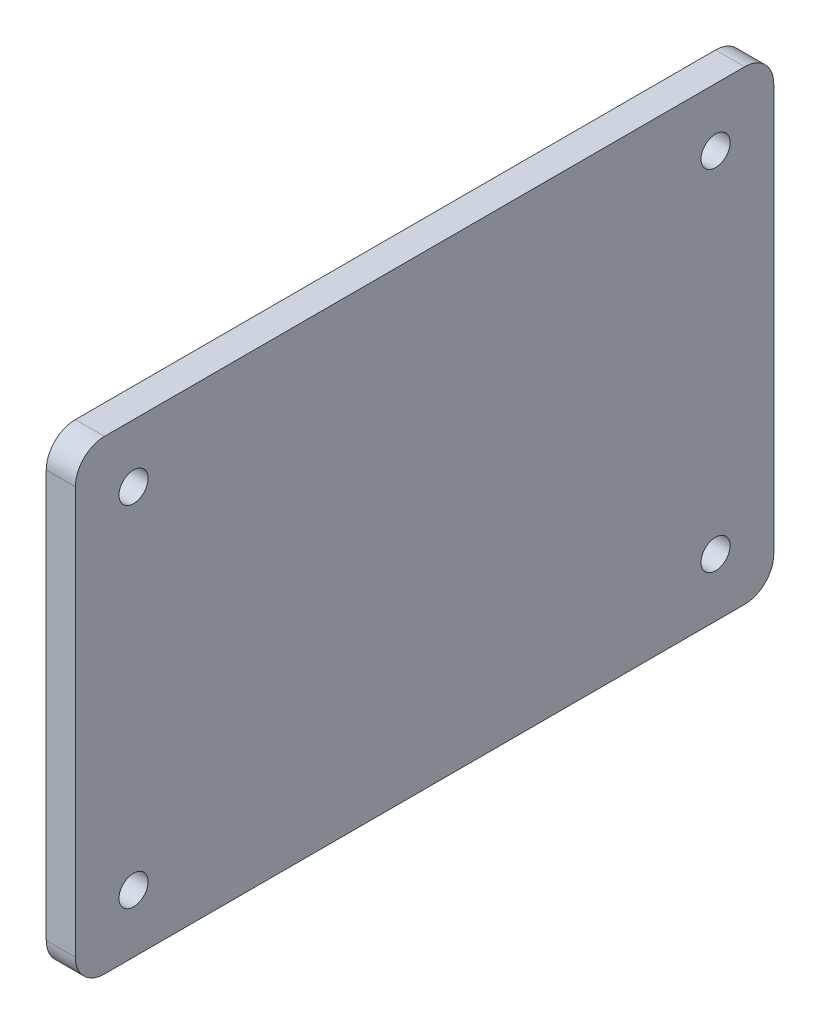
ISO-10303-21;
HEADER;
FILE_DESCRIPTION(('STEP AP214'),'2;1');
FILE_NAME('part.step','',(''),(''),'','','');
FILE_SCHEMA(('AUTOMOTIVE_DESIGN { 1 0 10303 214 1 1 1 1 }'));
ENDSEC;
DATA;
#1=APPLICATION_CONTEXT('core data for automotive mechanical design processes');
#2=APPLICATION_PROTOCOL_DEFINITION('international standard','automotive_design',2000,#1);
#3=PRODUCT_CONTEXT('',#1,'mechanical');
#4=PRODUCT('Part','Part','',(#3));
#5=PRODUCT_RELATED_PRODUCT_CATEGORY('part','',(#4));
#6=PRODUCT_DEFINITION_FORMATION('','',#4);
#7=PRODUCT_DEFINITION_CONTEXT('part definition',#1,'design');
#8=PRODUCT_DEFINITION('design','',#6,#7);
#9=PRODUCT_DEFINITION_SHAPE('','',#8);
#10=(LENGTH_UNIT() NAMED_UNIT(*) SI_UNIT(.MILLI.,.METRE.));
#11=(NAMED_UNIT(*) PLANE_ANGLE_UNIT() SI_UNIT($,.RADIAN.));
#12=(NAMED_UNIT(*) SI_UNIT($,.STERADIAN.) SOLID_ANGLE_UNIT());
#13=UNCERTAINTY_MEASURE_WITH_UNIT(LENGTH_MEASURE(1.E-05),#10,'distance_accuracy_value','');
#14=(GEOMETRIC_REPRESENTATION_CONTEXT(3) GLOBAL_UNCERTAINTY_ASSIGNED_CONTEXT((#13)) GLOBAL_UNIT_ASSIGNED_CONTEXT((#10,
#11,#12)) REPRESENTATION_CONTEXT('',''));
#15=CARTESIAN_POINT('',(0.,0.,0.));
#16=DIRECTION('',(0.,0.,1.));
#17=DIRECTION('',(1.,0.,0.));
#18=AXIS2_PLACEMENT_3D('',#15,#16,#17);
#19=CARTESIAN_POINT('',(-330.199999999993,107.95,-279.400000000002));
#20=DIRECTION('',(-1.,0.,0.));
#21=DIRECTION('',(0.,0.,1.));
#22=AXIS2_PLACEMENT_3D('',#19,#20,#21);
#23=CYLINDRICAL_SURFACE('',#22,3.17499999999998);
#24=CARTESIAN_POINT('',(-323.849999999993,107.95,-279.400000000002));
#25=DIRECTION('',(-1.,0.,0.));
#26=DIRECTION('',(0.,0.,1.));
#27=AXIS2_PLACEMENT_3D('',#24,#25,#26);
#28=CIRCLE('',#27,3.17499999999998);
#29=CARTESIAN_POINT('',(-323.849999999993,107.95,-276.225000000002));
#30=VERTEX_POINT('',#29);
#31=EDGE_CURVE('E174',#30,#30,#28,.T.);
#32=ORIENTED_EDGE('',*,*,#31,.F.);
#33=EDGE_LOOP('',(#32));
#34=FACE_BOUND('',#33,.T.);
#35=CARTESIAN_POINT('',(-330.199999999993,107.95,-279.400000000002));
#36=DIRECTION('',(-1.,0.,0.));
#37=DIRECTION('',(0.,0.,1.));
#38=AXIS2_PLACEMENT_3D('',#35,#36,#37);
#39=CIRCLE('',#38,3.17499999999998);
#40=CARTESIAN_POINT('',(-330.199999999993,107.95,-276.225000000002));
#41=VERTEX_POINT('',#40);
#42=EDGE_CURVE('E178',#41,#41,#39,.T.);
#43=ORIENTED_EDGE('',*,*,#42,.T.);
#44=EDGE_LOOP('',(#43));
#45=FACE_BOUND('',#44,.T.);
#46=ADVANCED_FACE('F57',(#34,#45),#23,.F.);
#47=CARTESIAN_POINT('',(-330.199999999993,31.75,-279.400000000002));
#48=DIRECTION('',(-1.,0.,0.));
#49=DIRECTION('',(0.,0.,1.));
#50=AXIS2_PLACEMENT_3D('',#47,#48,#49);
#51=CYLINDRICAL_SURFACE('',#50,3.17499999999998);
#52=CARTESIAN_POINT('',(-323.849999999993,31.75,-279.400000000002));
#53=DIRECTION('',(-1.,0.,0.));
#54=DIRECTION('',(0.,0.,1.));
#55=AXIS2_PLACEMENT_3D('',#52,#53,#54);
#56=CIRCLE('',#55,3.17499999999998);
#57=CARTESIAN_POINT('',(-323.849999999993,31.75,-276.225000000002));
#58=VERTEX_POINT('',#57);
#59=EDGE_CURVE('E166',#58,#58,#56,.T.);
#60=ORIENTED_EDGE('',*,*,#59,.F.);
#61=EDGE_LOOP('',(#60));
#62=FACE_BOUND('',#61,.T.);
#63=CARTESIAN_POINT('',(-330.199999999993,31.75,-279.400000000002));
#64=DIRECTION('',(-1.,0.,0.));
#65=DIRECTION('',(0.,0.,1.));
#66=AXIS2_PLACEMENT_3D('',#63,#64,#65);
#67=CIRCLE('',#66,3.17499999999998);
#68=CARTESIAN_POINT('',(-330.199999999993,31.75,-276.225000000002));
#69=VERTEX_POINT('',#68);
#70=EDGE_CURVE('E170',#69,#69,#67,.T.);
#71=ORIENTED_EDGE('',*,*,#70,.T.);
#72=EDGE_LOOP('',(#71));
#73=FACE_BOUND('',#72,.T.);
#74=ADVANCED_FACE('F277',(#62,#73),#51,.F.);
#75=CARTESIAN_POINT('',(-330.199999999993,120.65,-419.100000000002));
#76=DIRECTION('',(0.,0.,1.));
#77=DIRECTION('',(1.,0.,0.));
#78=AXIS2_PLACEMENT_3D('',#75,#76,#77);
#79=PLANE('',#78);
#80=DIRECTION('',(0.,-1.,0.));
#81=VECTOR('',#80,1.);
#82=CARTESIAN_POINT('',(-323.849999999993,120.65,-419.100000000002));
#83=LINE('',#82,#81);
#84=CARTESIAN_POINT('',(-323.849999999993,114.3,-419.100000000002));
#85=VERTEX_POINT('',#84);
#86=CARTESIAN_POINT('',(-323.849999999993,25.4,-419.100000000002));
#87=VERTEX_POINT('',#86);
#88=EDGE_CURVE('E220',#85,#87,#83,.T.);
#89=ORIENTED_EDGE('',*,*,#88,.T.);
#90=DIRECTION('',(1.,0.,0.));
#91=VECTOR('',#90,1.);
#92=CARTESIAN_POINT('',(-330.199999999993,25.4,-419.100000000002));
#93=LINE('',#92,#91);
#94=CARTESIAN_POINT('',(-330.199999999993,25.4,-419.100000000002));
#95=VERTEX_POINT('',#94);
#96=EDGE_CURVE('E13',#87,#95,#93,.F.);
#97=ORIENTED_EDGE('',*,*,#96,.T.);
#98=DIRECTION('',(0.,-1.,0.));
#99=VECTOR('',#98,1.);
#100=CARTESIAN_POINT('',(-330.199999999993,120.65,-419.100000000002));
#101=LINE('',#100,#99);
#102=CARTESIAN_POINT('',(-330.199999999993,114.3,-419.100000000002));
#103=VERTEX_POINT('',#102);
#104=EDGE_CURVE('E154',#103,#95,#101,.T.);
#105=ORIENTED_EDGE('',*,*,#104,.F.);
#106=DIRECTION('',(1.,0.,0.));
#107=VECTOR('',#106,1.);
#108=CARTESIAN_POINT('',(-330.199999999993,114.3,-419.100000000002));
#109=LINE('',#108,#107);
#110=EDGE_CURVE('E66',#103,#85,#109,.T.);
#111=ORIENTED_EDGE('',*,*,#110,.T.);
#112=EDGE_LOOP('',(#89,#97,#105,#111));
#113=FACE_BOUND('',#112,.T.);
#114=ADVANCED_FACE('F219',(#113),#79,.F.);
#115=CARTESIAN_POINT('',(-330.199999999993,19.05,-419.100000000002));
#116=DIRECTION('',(0.,1.,0.));
#117=DIRECTION('',(0.,0.,1.));
#118=AXIS2_PLACEMENT_3D('',#115,#116,#117);
#119=PLANE('',#118);
#120=DIRECTION('',(0.,0.,1.));
#121=VECTOR('',#120,1.);
#122=CARTESIAN_POINT('',(-323.849999999993,19.05,-419.100000000002));
#123=LINE('',#122,#121);
#124=CARTESIAN_POINT('',(-323.849999999993,19.05,-412.750000000002));
#125=VERTEX_POINT('',#124);
#126=CARTESIAN_POINT('',(-323.849999999993,19.05,-273.050000000002));
#127=VERTEX_POINT('',#126);
#128=EDGE_CURVE('E162',#125,#127,#123,.T.);
#129=ORIENTED_EDGE('',*,*,#128,.T.);
#130=DIRECTION('',(1.,0.,0.));
#131=VECTOR('',#130,1.);
#132=CARTESIAN_POINT('',(-330.199999999993,19.05,-273.050000000002));
#133=LINE('',#132,#131);
#134=CARTESIAN_POINT('',(-330.199999999993,19.05,-273.050000000002));
#135=VERTEX_POINT('',#134);
#136=EDGE_CURVE('E73',#127,#135,#133,.F.);
#137=ORIENTED_EDGE('',*,*,#136,.T.);
#138=DIRECTION('',(0.,0.,1.));
#139=VECTOR('',#138,1.);
#140=CARTESIAN_POINT('',(-330.199999999993,19.05,-419.100000000002));
#141=LINE('',#140,#139);
#142=CARTESIAN_POINT('',(-330.199999999993,19.05,-412.750000000002));
#143=VERTEX_POINT('',#142);
#144=EDGE_CURVE('E160',#143,#135,#141,.T.);
#145=ORIENTED_EDGE('',*,*,#144,.F.);
#146=DIRECTION('',(1.,0.,0.));
#147=VECTOR('',#146,1.);
#148=CARTESIAN_POINT('',(-330.199999999993,19.05,-412.750000000002));
#149=LINE('',#148,#147);
#150=EDGE_CURVE('E207',#143,#125,#149,.T.);
#151=ORIENTED_EDGE('',*,*,#150,.T.);
#152=EDGE_LOOP('',(#129,#137,#145,#151));
#153=FACE_BOUND('',#152,.T.);
#154=ADVANCED_FACE('F301',(#153),#119,.F.);
#155=CARTESIAN_POINT('',(-330.199999999993,120.65,-266.700000000002));
#156=DIRECTION('',(0.,0.,-1.));
#157=DIRECTION('',(-1.,0.,0.));
#158=AXIS2_PLACEMENT_3D('',#155,#156,#157);
#159=PLANE('',#158);
#160=DIRECTION('',(0.,1.,0.));
#161=VECTOR('',#160,1.);
#162=CARTESIAN_POINT('',(-323.849999999993,120.65,-266.700000000002));
#163=LINE('',#162,#161);
#164=CARTESIAN_POINT('',(-323.849999999993,25.4,-266.700000000002));
#165=VERTEX_POINT('',#164);
#166=CARTESIAN_POINT('',(-323.849999999993,114.3,-266.700000000002));
#167=VERTEX_POINT('',#166);
#168=EDGE_CURVE('E155',#165,#167,#163,.T.);
#169=ORIENTED_EDGE('',*,*,#168,.T.);
#170=DIRECTION('',(1.,0.,0.));
#171=VECTOR('',#170,1.);
#172=CARTESIAN_POINT('',(-330.199999999993,114.3,-266.700000000002));
#173=LINE('',#172,#171);
#174=CARTESIAN_POINT('',(-330.199999999993,114.3,-266.700000000002));
#175=VERTEX_POINT('',#174);
#176=EDGE_CURVE('E129',#167,#175,#173,.F.);
#177=ORIENTED_EDGE('',*,*,#176,.T.);
#178=DIRECTION('',(0.,1.,0.));
#179=VECTOR('',#178,1.);
#180=CARTESIAN_POINT('',(-330.199999999993,120.65,-266.700000000002));
#181=LINE('',#180,#179);
#182=CARTESIAN_POINT('',(-330.199999999993,25.4,-266.700000000002));
#183=VERTEX_POINT('',#182);
#184=EDGE_CURVE('E237',#183,#175,#181,.T.);
#185=ORIENTED_EDGE('',*,*,#184,.F.);
#186=DIRECTION('',(1.,0.,0.));
#187=VECTOR('',#186,1.);
#188=CARTESIAN_POINT('',(-330.199999999993,25.4,-266.700000000002));
#189=LINE('',#188,#187);
#190=EDGE_CURVE('E135',#183,#165,#189,.T.);
#191=ORIENTED_EDGE('',*,*,#190,.T.);
#192=EDGE_LOOP('',(#169,#177,#185,#191));
#193=FACE_BOUND('',#192,.T.);
#194=ADVANCED_FACE('F305',(#193),#159,.F.);
#195=CARTESIAN_POINT('',(-330.199999999993,120.65,-419.100000000002));
#196=DIRECTION('',(0.,-1.,0.));
#197=DIRECTION('',(0.,0.,-1.));
#198=AXIS2_PLACEMENT_3D('',#195,#196,#197);
#199=PLANE('',#198);
#200=DIRECTION('',(0.,0.,-1.));
#201=VECTOR('',#200,1.);
#202=CARTESIAN_POINT('',(-330.199999999993,120.65,-419.100000000002));
#203=LINE('',#202,#201);
#204=CARTESIAN_POINT('',(-330.199999999993,120.65,-273.050000000002));
#205=VERTEX_POINT('',#204);
#206=CARTESIAN_POINT('',(-330.199999999993,120.65,-412.750000000002));
#207=VERTEX_POINT('',#206);
#208=EDGE_CURVE('E145',#205,#207,#203,.T.);
#209=ORIENTED_EDGE('',*,*,#208,.F.);
#210=DIRECTION('',(1.,0.,0.));
#211=VECTOR('',#210,1.);
#212=CARTESIAN_POINT('',(-330.199999999993,120.65,-273.050000000002));
#213=LINE('',#212,#211);
#214=CARTESIAN_POINT('',(-323.849999999993,120.65,-273.050000000002));
#215=VERTEX_POINT('',#214);
#216=EDGE_CURVE('E128',#205,#215,#213,.T.);
#217=ORIENTED_EDGE('',*,*,#216,.T.);
#218=DIRECTION('',(0.,0.,-1.));
#219=VECTOR('',#218,1.);
#220=CARTESIAN_POINT('',(-323.849999999993,120.65,-419.100000000002));
#221=LINE('',#220,#219);
#222=CARTESIAN_POINT('',(-323.849999999993,120.65,-412.750000000002));
#223=VERTEX_POINT('',#222);
#224=EDGE_CURVE('E142',#215,#223,#221,.T.);
#225=ORIENTED_EDGE('',*,*,#224,.T.);
#226=DIRECTION('',(1.,0.,0.));
#227=VECTOR('',#226,1.);
#228=CARTESIAN_POINT('',(-330.199999999993,120.65,-412.750000000002));
#229=LINE('',#228,#227);
#230=EDGE_CURVE('E148',#223,#207,#229,.F.);
#231=ORIENTED_EDGE('',*,*,#230,.T.);
#232=EDGE_LOOP('',(#209,#217,#225,#231));
#233=FACE_BOUND('',#232,.T.);
#234=ADVANCED_FACE('F141',(#233),#199,.F.);
#235=CARTESIAN_POINT('',(-330.199999999993,0.,0.));
#236=DIRECTION('',(-1.,0.,0.));
#237=DIRECTION('',(0.,0.,1.));
#238=AXIS2_PLACEMENT_3D('',#235,#236,#237);
#239=PLANE('',#238);
#240=CARTESIAN_POINT('',(-330.199999999993,107.95,-406.400000000002));
#241=DIRECTION('',(-1.,0.,0.));
#242=DIRECTION('',(0.,0.,1.));
#243=AXIS2_PLACEMENT_3D('',#240,#241,#242);
#244=CIRCLE('',#243,3.17499999999998);
#245=CARTESIAN_POINT('',(-330.199999999993,107.95,-403.225000000002));
#246=VERTEX_POINT('',#245);
#247=EDGE_CURVE('E246',#246,#246,#244,.T.);
#248=ORIENTED_EDGE('',*,*,#247,.F.);
#249=EDGE_LOOP('',(#248));
#250=FACE_BOUND('',#249,.T.);
#251=CARTESIAN_POINT('',(-330.199999999993,31.75,-406.400000000002));
#252=DIRECTION('',(-1.,0.,0.));
#253=DIRECTION('',(0.,0.,1.));
#254=AXIS2_PLACEMENT_3D('',#251,#252,#253);
#255=CIRCLE('',#254,3.17499999999998);
#256=CARTESIAN_POINT('',(-330.199999999993,31.75,-403.225000000002));
#257=VERTEX_POINT('',#256);
#258=EDGE_CURVE('E232',#257,#257,#255,.T.);
#259=ORIENTED_EDGE('',*,*,#258,.F.);
#260=EDGE_LOOP('',(#259));
#261=FACE_BOUND('',#260,.T.);
#262=ORIENTED_EDGE('',*,*,#184,.T.);
#263=CARTESIAN_POINT('',(-330.199999999993,114.3,-273.050000000002));
#264=DIRECTION('',(-1.,0.,0.));
#265=DIRECTION('',(0.,0.,1.));
#266=AXIS2_PLACEMENT_3D('',#263,#264,#265);
#267=CIRCLE('',#266,6.35);
#268=EDGE_CURVE('E204',#175,#205,#267,.T.);
#269=ORIENTED_EDGE('',*,*,#268,.T.);
#270=ORIENTED_EDGE('',*,*,#208,.T.);
#271=CARTESIAN_POINT('',(-330.199999999993,114.3,-412.750000000002));
#272=DIRECTION('',(-1.,0.,0.));
#273=DIRECTION('',(0.,0.,1.));
#274=AXIS2_PLACEMENT_3D('',#271,#272,#273);
#275=CIRCLE('',#274,6.35);
#276=EDGE_CURVE('E196',#207,#103,#275,.T.);
#277=ORIENTED_EDGE('',*,*,#276,.T.);
#278=ORIENTED_EDGE('',*,*,#104,.T.);
#279=CARTESIAN_POINT('',(-330.199999999993,25.4,-412.750000000002));
#280=DIRECTION('',(-1.,0.,0.));
#281=DIRECTION('',(0.,0.,1.));
#282=AXIS2_PLACEMENT_3D('',#279,#280,#281);
#283=CIRCLE('',#282,6.35);
#284=EDGE_CURVE('E80',#95,#143,#283,.T.);
#285=ORIENTED_EDGE('',*,*,#284,.T.);
#286=ORIENTED_EDGE('',*,*,#144,.T.);
#287=CARTESIAN_POINT('',(-330.199999999993,25.4,-273.050000000002));
#288=DIRECTION('',(-1.,0.,0.));
#289=DIRECTION('',(0.,0.,1.));
#290=AXIS2_PLACEMENT_3D('',#287,#288,#289);
#291=CIRCLE('',#290,6.35);
#292=EDGE_CURVE('E201',#135,#183,#291,.T.);
#293=ORIENTED_EDGE('',*,*,#292,.T.);
#294=EDGE_LOOP('',(#262,#269,#270,#277,#278,#285,#286,#293));
#295=FACE_BOUND('',#294,.T.);
#296=ORIENTED_EDGE('',*,*,#70,.F.);
#297=EDGE_LOOP('',(#296));
#298=FACE_BOUND('',#297,.T.);
#299=ORIENTED_EDGE('',*,*,#42,.F.);
#300=EDGE_LOOP('',(#299));
#301=FACE_BOUND('',#300,.T.);
#302=ADVANCED_FACE('F265',(#250,#261,#295,#298,#301),#239,.T.);
#303=CARTESIAN_POINT('',(-323.849999999993,0.,0.));
#304=DIRECTION('',(-1.,0.,0.));
#305=DIRECTION('',(0.,0.,1.));
#306=AXIS2_PLACEMENT_3D('',#303,#304,#305);
#307=PLANE('',#306);
#308=CARTESIAN_POINT('',(-323.849999999993,107.95,-406.400000000002));
#309=DIRECTION('',(-1.,0.,0.));
#310=DIRECTION('',(0.,0.,1.));
#311=AXIS2_PLACEMENT_3D('',#308,#309,#310);
#312=CIRCLE('',#311,3.17499999999998);
#313=CARTESIAN_POINT('',(-323.849999999993,107.95,-403.225000000002));
#314=VERTEX_POINT('',#313);
#315=EDGE_CURVE('E250',#314,#314,#312,.T.);
#316=ORIENTED_EDGE('',*,*,#315,.T.);
#317=EDGE_LOOP('',(#316));
#318=FACE_BOUND('',#317,.T.);
#319=CARTESIAN_POINT('',(-323.849999999993,31.75,-406.400000000002));
#320=DIRECTION('',(-1.,0.,0.));
#321=DIRECTION('',(0.,0.,1.));
#322=AXIS2_PLACEMENT_3D('',#319,#320,#321);
#323=CIRCLE('',#322,3.17499999999998);
#324=CARTESIAN_POINT('',(-323.849999999993,31.75,-403.225000000002));
#325=VERTEX_POINT('',#324);
#326=EDGE_CURVE('E226',#325,#325,#323,.T.);
#327=ORIENTED_EDGE('',*,*,#326,.T.);
#328=EDGE_LOOP('',(#327));
#329=FACE_BOUND('',#328,.T.);
#330=ORIENTED_EDGE('',*,*,#224,.F.);
#331=CARTESIAN_POINT('',(-323.849999999993,114.3,-273.050000000002));
#332=DIRECTION('',(-1.,0.,0.));
#333=DIRECTION('',(0.,0.,1.));
#334=AXIS2_PLACEMENT_3D('',#331,#332,#333);
#335=CIRCLE('',#334,6.35);
#336=EDGE_CURVE('E124',#215,#167,#335,.F.);
#337=ORIENTED_EDGE('',*,*,#336,.T.);
#338=ORIENTED_EDGE('',*,*,#168,.F.);
#339=CARTESIAN_POINT('',(-323.849999999993,25.4,-273.050000000002));
#340=DIRECTION('',(-1.,0.,0.));
#341=DIRECTION('',(0.,0.,1.));
#342=AXIS2_PLACEMENT_3D('',#339,#340,#341);
#343=CIRCLE('',#342,6.35);
#344=EDGE_CURVE('E136',#165,#127,#343,.F.);
#345=ORIENTED_EDGE('',*,*,#344,.T.);
#346=ORIENTED_EDGE('',*,*,#128,.F.);
#347=CARTESIAN_POINT('',(-323.849999999993,25.4,-412.750000000002));
#348=DIRECTION('',(-1.,0.,0.));
#349=DIRECTION('',(0.,0.,1.));
#350=AXIS2_PLACEMENT_3D('',#347,#348,#349);
#351=CIRCLE('',#350,6.35);
#352=EDGE_CURVE('E186',#125,#87,#351,.F.);
#353=ORIENTED_EDGE('',*,*,#352,.T.);
#354=ORIENTED_EDGE('',*,*,#88,.F.);
#355=CARTESIAN_POINT('',(-323.849999999993,114.3,-412.750000000002));
#356=DIRECTION('',(-1.,0.,0.));
#357=DIRECTION('',(0.,0.,1.));
#358=AXIS2_PLACEMENT_3D('',#355,#356,#357);
#359=CIRCLE('',#358,6.35);
#360=EDGE_CURVE('E147',#85,#223,#359,.F.);
#361=ORIENTED_EDGE('',*,*,#360,.T.);
#362=EDGE_LOOP('',(#330,#337,#338,#345,#346,#353,#354,#361));
#363=FACE_BOUND('',#362,.T.);
#364=ORIENTED_EDGE('',*,*,#59,.T.);
#365=EDGE_LOOP('',(#364));
#366=FACE_BOUND('',#365,.T.);
#367=ORIENTED_EDGE('',*,*,#31,.T.);
#368=EDGE_LOOP('',(#367));
#369=FACE_BOUND('',#368,.T.);
#370=ADVANCED_FACE('F150',(#318,#329,#363,#366,#369),#307,.F.);
#371=CARTESIAN_POINT('',(-330.199999999993,31.75,-406.400000000002));
#372=DIRECTION('',(-1.,0.,0.));
#373=DIRECTION('',(0.,0.,1.));
#374=AXIS2_PLACEMENT_3D('',#371,#372,#373);
#375=CYLINDRICAL_SURFACE('',#374,3.17499999999998);
#376=ORIENTED_EDGE('',*,*,#326,.F.);
#377=EDGE_LOOP('',(#376));
#378=FACE_BOUND('',#377,.T.);
#379=ORIENTED_EDGE('',*,*,#258,.T.);
#380=EDGE_LOOP('',(#379));
#381=FACE_BOUND('',#380,.T.);
#382=ADVANCED_FACE('F261',(#378,#381),#375,.F.);
#383=CARTESIAN_POINT('',(-330.199999999993,107.95,-406.400000000002));
#384=DIRECTION('',(-1.,0.,0.));
#385=DIRECTION('',(0.,0.,1.));
#386=AXIS2_PLACEMENT_3D('',#383,#384,#385);
#387=CYLINDRICAL_SURFACE('',#386,3.17499999999998);
#388=ORIENTED_EDGE('',*,*,#315,.F.);
#389=EDGE_LOOP('',(#388));
#390=FACE_BOUND('',#389,.T.);
#391=ORIENTED_EDGE('',*,*,#247,.T.);
#392=EDGE_LOOP('',(#391));
#393=FACE_BOUND('',#392,.T.);
#394=ADVANCED_FACE('F258',(#390,#393),#387,.F.);
#395=CARTESIAN_POINT('',(-330.199999999993,114.3,-273.050000000002));
#396=DIRECTION('',(1.,0.,0.));
#397=DIRECTION('',(0.,0.,-1.));
#398=AXIS2_PLACEMENT_3D('',#395,#396,#397);
#399=CYLINDRICAL_SURFACE('',#398,6.35);
#400=ORIENTED_EDGE('',*,*,#268,.F.);
#401=ORIENTED_EDGE('',*,*,#176,.F.);
#402=ORIENTED_EDGE('',*,*,#336,.F.);
#403=ORIENTED_EDGE('',*,*,#216,.F.);
#404=EDGE_LOOP('',(#400,#401,#402,#403));
#405=FACE_BOUND('',#404,.T.);
#406=ADVANCED_FACE('F127',(#405),#399,.T.);
#407=CARTESIAN_POINT('',(-330.199999999993,25.4,-273.050000000002));
#408=DIRECTION('',(1.,0.,0.));
#409=DIRECTION('',(0.,0.,-1.));
#410=AXIS2_PLACEMENT_3D('',#407,#408,#409);
#411=CYLINDRICAL_SURFACE('',#410,6.35);
#412=ORIENTED_EDGE('',*,*,#292,.F.);
#413=ORIENTED_EDGE('',*,*,#136,.F.);
#414=ORIENTED_EDGE('',*,*,#344,.F.);
#415=ORIENTED_EDGE('',*,*,#190,.F.);
#416=EDGE_LOOP('',(#412,#413,#414,#415));
#417=FACE_BOUND('',#416,.T.);
#418=ADVANCED_FACE('F291',(#417),#411,.T.);
#419=CARTESIAN_POINT('',(-330.199999999993,25.4,-412.750000000002));
#420=DIRECTION('',(1.,0.,0.));
#421=DIRECTION('',(0.,0.,-1.));
#422=AXIS2_PLACEMENT_3D('',#419,#420,#421);
#423=CYLINDRICAL_SURFACE('',#422,6.35);
#424=ORIENTED_EDGE('',*,*,#284,.F.);
#425=ORIENTED_EDGE('',*,*,#96,.F.);
#426=ORIENTED_EDGE('',*,*,#352,.F.);
#427=ORIENTED_EDGE('',*,*,#150,.F.);
#428=EDGE_LOOP('',(#424,#425,#426,#427));
#429=FACE_BOUND('',#428,.T.);
#430=ADVANCED_FACE('F293',(#429),#423,.T.);
#431=CARTESIAN_POINT('',(-330.199999999993,114.3,-412.750000000002));
#432=DIRECTION('',(1.,0.,0.));
#433=DIRECTION('',(0.,0.,-1.));
#434=AXIS2_PLACEMENT_3D('',#431,#432,#433);
#435=CYLINDRICAL_SURFACE('',#434,6.35);
#436=ORIENTED_EDGE('',*,*,#276,.F.);
#437=ORIENTED_EDGE('',*,*,#230,.F.);
#438=ORIENTED_EDGE('',*,*,#360,.F.);
#439=ORIENTED_EDGE('',*,*,#110,.F.);
#440=EDGE_LOOP('',(#436,#437,#438,#439));
#441=FACE_BOUND('',#440,.T.);
#442=ADVANCED_FACE('F59',(#441),#435,.T.);
#443=CLOSED_SHELL('',(#46,#74,#114,#154,#194,#234,#302,#370,#382,#394,#406,#418,#430,#442));
#444=MANIFOLD_SOLID_BREP('B2',#443);
#445=ADVANCED_BREP_SHAPE_REPRESENTATION('',(#18,#444),#14);
#446=SHAPE_DEFINITION_REPRESENTATION(#9,#445);
ENDSEC;
END-ISO-10303-21;
